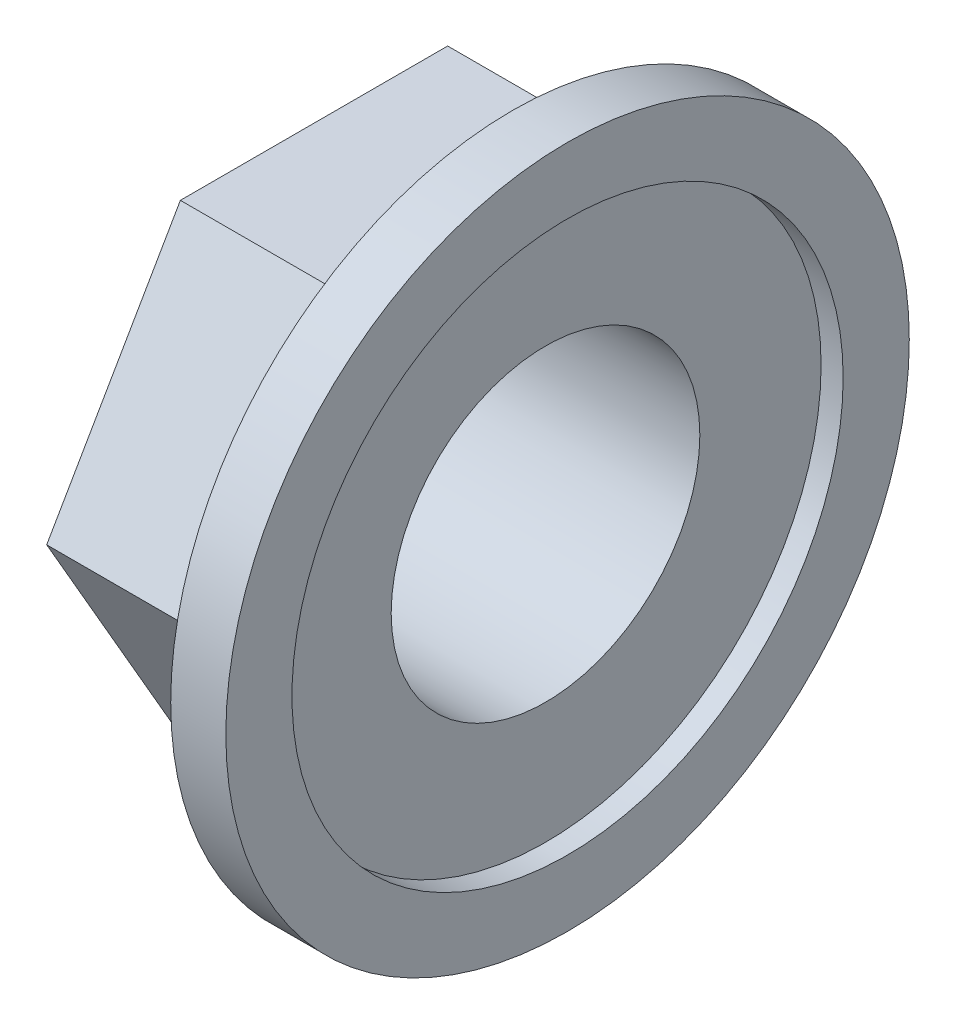
ISO-10303-21;
HEADER;
FILE_DESCRIPTION(('STEP AP214'),'2;1');
FILE_NAME('part.step','',(''),(''),'','','');
FILE_SCHEMA(('AUTOMOTIVE_DESIGN { 1 0 10303 214 1 1 1 1 }'));
ENDSEC;
DATA;
#1=APPLICATION_CONTEXT('core data for automotive mechanical design processes');
#2=APPLICATION_PROTOCOL_DEFINITION('international standard','automotive_design',2000,#1);
#3=PRODUCT_CONTEXT('',#1,'mechanical');
#4=PRODUCT('Part','Part','',(#3));
#5=PRODUCT_RELATED_PRODUCT_CATEGORY('part','',(#4));
#6=PRODUCT_DEFINITION_FORMATION('','',#4);
#7=PRODUCT_DEFINITION_CONTEXT('part definition',#1,'design');
#8=PRODUCT_DEFINITION('design','',#6,#7);
#9=PRODUCT_DEFINITION_SHAPE('','',#8);
#10=(LENGTH_UNIT() NAMED_UNIT(*) SI_UNIT(.MILLI.,.METRE.));
#11=(NAMED_UNIT(*) PLANE_ANGLE_UNIT() SI_UNIT($,.RADIAN.));
#12=(NAMED_UNIT(*) SI_UNIT($,.STERADIAN.) SOLID_ANGLE_UNIT());
#13=UNCERTAINTY_MEASURE_WITH_UNIT(LENGTH_MEASURE(1.E-05),#10,'distance_accuracy_value','');
#14=(GEOMETRIC_REPRESENTATION_CONTEXT(3) GLOBAL_UNCERTAINTY_ASSIGNED_CONTEXT((#13)) GLOBAL_UNIT_ASSIGNED_CONTEXT((#10,
#11,#12)) REPRESENTATION_CONTEXT('',''));
#15=CARTESIAN_POINT('',(0.,0.,0.));
#16=DIRECTION('',(0.,0.,1.));
#17=DIRECTION('',(1.,0.,0.));
#18=AXIS2_PLACEMENT_3D('',#15,#16,#17);
#19=CARTESIAN_POINT('',(0.,0.,0.));
#20=DIRECTION('',(1.,0.,0.));
#21=DIRECTION('',(0.,0.,-1.));
#22=AXIS2_PLACEMENT_3D('',#19,#20,#21);
#23=PLANE('',#22);
#24=CARTESIAN_POINT('',(0.,0.,0.));
#25=DIRECTION('',(1.,0.,0.));
#26=DIRECTION('',(0.,0.,-1.));
#27=AXIS2_PLACEMENT_3D('',#24,#25,#26);
#28=CIRCLE('',#27,15.5);
#29=CARTESIAN_POINT('',(0.,0.,-15.5));
#30=VERTEX_POINT('',#29);
#31=EDGE_CURVE('E49',#30,#30,#28,.T.);
#32=ORIENTED_EDGE('',*,*,#31,.F.);
#33=EDGE_LOOP('',(#32));
#34=FACE_BOUND('',#33,.T.);
#35=DIRECTION('',(0.,0.866025403784439,0.5));
#36=VECTOR('',#35,1.);
#37=CARTESIAN_POINT('',(0.,-10.5,6.06217782649107));
#38=LINE('',#37,#36);
#39=CARTESIAN_POINT('',(0.,-10.5,6.06217782649107));
#40=VERTEX_POINT('',#39);
#41=CARTESIAN_POINT('',(0.,0.,12.1243556529821));
#42=VERTEX_POINT('',#41);
#43=EDGE_CURVE('E57',#40,#42,#38,.T.);
#44=ORIENTED_EDGE('',*,*,#43,.F.);
#45=DIRECTION('',(0.,0.,1.));
#46=VECTOR('',#45,1.);
#47=CARTESIAN_POINT('',(0.,-10.5,-6.06217782649107));
#48=LINE('',#47,#46);
#49=CARTESIAN_POINT('',(0.,-10.5,-6.06217782649107));
#50=VERTEX_POINT('',#49);
#51=EDGE_CURVE('E61',#50,#40,#48,.T.);
#52=ORIENTED_EDGE('',*,*,#51,.F.);
#53=DIRECTION('',(0.,-0.866025403784438,0.5));
#54=VECTOR('',#53,1.);
#55=CARTESIAN_POINT('',(0.,0.,-12.1243556529821));
#56=LINE('',#55,#54);
#57=CARTESIAN_POINT('',(0.,0.,-12.1243556529821));
#58=VERTEX_POINT('',#57);
#59=EDGE_CURVE('E216',#58,#50,#56,.T.);
#60=ORIENTED_EDGE('',*,*,#59,.F.);
#61=DIRECTION('',(0.,-0.866025403784438,-0.5));
#62=VECTOR('',#61,1.);
#63=CARTESIAN_POINT('',(0.,10.5,-6.06217782649107));
#64=LINE('',#63,#62);
#65=CARTESIAN_POINT('',(0.,10.5,-6.06217782649107));
#66=VERTEX_POINT('',#65);
#67=EDGE_CURVE('E212',#66,#58,#64,.T.);
#68=ORIENTED_EDGE('',*,*,#67,.F.);
#69=DIRECTION('',(0.,0.,-1.));
#70=VECTOR('',#69,1.);
#71=CARTESIAN_POINT('',(0.,10.5,6.06217782649107));
#72=LINE('',#71,#70);
#73=CARTESIAN_POINT('',(0.,10.5,6.06217782649107));
#74=VERTEX_POINT('',#73);
#75=EDGE_CURVE('E208',#74,#66,#72,.T.);
#76=ORIENTED_EDGE('',*,*,#75,.F.);
#77=DIRECTION('',(0.,0.866025403784439,-0.5));
#78=VECTOR('',#77,1.);
#79=CARTESIAN_POINT('',(0.,0.,12.1243556529821));
#80=LINE('',#79,#78);
#81=EDGE_CURVE('E192',#42,#74,#80,.T.);
#82=ORIENTED_EDGE('',*,*,#81,.F.);
#83=EDGE_LOOP('',(#44,#52,#60,#68,#76,#82));
#84=FACE_BOUND('',#83,.T.);
#85=ADVANCED_FACE('F39',(#34,#84),#23,.F.);
#86=CARTESIAN_POINT('',(2.5,0.,0.));
#87=DIRECTION('',(-1.,0.,0.));
#88=DIRECTION('',(0.,0.,1.));
#89=AXIS2_PLACEMENT_3D('',#86,#87,#88);
#90=CYLINDRICAL_SURFACE('',#89,15.5);
#91=CARTESIAN_POINT('',(2.5,0.,0.));
#92=DIRECTION('',(1.,0.,0.));
#93=DIRECTION('',(0.,0.,-1.));
#94=AXIS2_PLACEMENT_3D('',#91,#92,#93);
#95=CIRCLE('',#94,15.5);
#96=CARTESIAN_POINT('',(2.5,0.,-15.5));
#97=VERTEX_POINT('',#96);
#98=EDGE_CURVE('E11',#97,#97,#95,.T.);
#99=ORIENTED_EDGE('',*,*,#98,.F.);
#100=EDGE_LOOP('',(#99));
#101=FACE_BOUND('',#100,.T.);
#102=ORIENTED_EDGE('',*,*,#31,.T.);
#103=EDGE_LOOP('',(#102));
#104=FACE_BOUND('',#103,.T.);
#105=ADVANCED_FACE('F41',(#101,#104),#90,.T.);
#106=CARTESIAN_POINT('',(2.5,0.,0.));
#107=DIRECTION('',(1.,0.,0.));
#108=DIRECTION('',(0.,0.,-1.));
#109=AXIS2_PLACEMENT_3D('',#106,#107,#108);
#110=PLANE('',#109);
#111=CARTESIAN_POINT('',(2.5,0.,0.));
#112=DIRECTION('',(1.,0.,0.));
#113=DIRECTION('',(0.,0.,-1.));
#114=AXIS2_PLACEMENT_3D('',#111,#112,#113);
#115=CIRCLE('',#114,12.5);
#116=CARTESIAN_POINT('',(2.5,0.,-12.5));
#117=VERTEX_POINT('',#116);
#118=EDGE_CURVE('E118',#117,#117,#115,.T.);
#119=ORIENTED_EDGE('',*,*,#118,.F.);
#120=EDGE_LOOP('',(#119));
#121=FACE_BOUND('',#120,.T.);
#122=ORIENTED_EDGE('',*,*,#98,.T.);
#123=EDGE_LOOP('',(#122));
#124=FACE_BOUND('',#123,.T.);
#125=ADVANCED_FACE('F140',(#121,#124),#110,.T.);
#126=CARTESIAN_POINT('',(1.5,0.,0.));
#127=DIRECTION('',(1.,0.,0.));
#128=DIRECTION('',(0.,0.,-1.));
#129=AXIS2_PLACEMENT_3D('',#126,#127,#128);
#130=CYLINDRICAL_SURFACE('',#129,12.5);
#131=CARTESIAN_POINT('',(1.5,0.,0.));
#132=DIRECTION('',(1.,0.,0.));
#133=DIRECTION('',(0.,0.,-1.));
#134=AXIS2_PLACEMENT_3D('',#131,#132,#133);
#135=CIRCLE('',#134,12.5);
#136=CARTESIAN_POINT('',(1.5,0.,-12.5));
#137=VERTEX_POINT('',#136);
#138=EDGE_CURVE('E123',#137,#137,#135,.T.);
#139=ORIENTED_EDGE('',*,*,#138,.F.);
#140=EDGE_LOOP('',(#139));
#141=FACE_BOUND('',#140,.T.);
#142=ORIENTED_EDGE('',*,*,#118,.T.);
#143=EDGE_LOOP('',(#142));
#144=FACE_BOUND('',#143,.T.);
#145=ADVANCED_FACE('F145',(#141,#144),#130,.F.);
#146=CARTESIAN_POINT('',(1.5,0.,0.));
#147=DIRECTION('',(1.,0.,0.));
#148=DIRECTION('',(0.,0.,-1.));
#149=AXIS2_PLACEMENT_3D('',#146,#147,#148);
#150=PLANE('',#149);
#151=CARTESIAN_POINT('',(1.5,0.,0.));
#152=DIRECTION('',(1.,0.,0.));
#153=DIRECTION('',(0.,0.,-1.));
#154=AXIS2_PLACEMENT_3D('',#151,#152,#153);
#155=CIRCLE('',#154,7.);
#156=CARTESIAN_POINT('',(1.5,0.,-7.));
#157=VERTEX_POINT('',#156);
#158=EDGE_CURVE('E185',#157,#157,#155,.T.);
#159=ORIENTED_EDGE('',*,*,#158,.F.);
#160=EDGE_LOOP('',(#159));
#161=FACE_BOUND('',#160,.T.);
#162=ORIENTED_EDGE('',*,*,#138,.T.);
#163=EDGE_LOOP('',(#162));
#164=FACE_BOUND('',#163,.T.);
#165=ADVANCED_FACE('F149',(#161,#164),#150,.T.);
#166=CARTESIAN_POINT('',(-9.,-10.5,6.06217782649107));
#167=DIRECTION('',(0.,0.5,-0.866025403784439));
#168=DIRECTION('',(0.,0.866025403784439,0.5));
#169=AXIS2_PLACEMENT_3D('',#166,#167,#168);
#170=PLANE('',#169);
#171=ORIENTED_EDGE('',*,*,#43,.T.);
#172=DIRECTION('',(1.,0.,0.));
#173=VECTOR('',#172,1.);
#174=CARTESIAN_POINT('',(-9.,0.,12.1243556529821));
#175=LINE('',#174,#173);
#176=CARTESIAN_POINT('',(-9.,0.,12.1243556529821));
#177=VERTEX_POINT('',#176);
#178=EDGE_CURVE('E98',#177,#42,#175,.T.);
#179=ORIENTED_EDGE('',*,*,#178,.F.);
#180=DIRECTION('',(0.,0.866025403784439,0.5));
#181=VECTOR('',#180,1.);
#182=CARTESIAN_POINT('',(-9.,-10.5,6.06217782649107));
#183=LINE('',#182,#181);
#184=CARTESIAN_POINT('',(-9.,-10.5,6.06217782649107));
#185=VERTEX_POINT('',#184);
#186=EDGE_CURVE('E105',#185,#177,#183,.T.);
#187=ORIENTED_EDGE('',*,*,#186,.F.);
#188=DIRECTION('',(1.,0.,0.));
#189=VECTOR('',#188,1.);
#190=CARTESIAN_POINT('',(-9.,-10.5,6.06217782649107));
#191=LINE('',#190,#189);
#192=EDGE_CURVE('E204',#185,#40,#191,.T.);
#193=ORIENTED_EDGE('',*,*,#192,.T.);
#194=EDGE_LOOP('',(#171,#179,#187,#193));
#195=FACE_BOUND('',#194,.T.);
#196=ADVANCED_FACE('F116',(#195),#170,.F.);
#197=CARTESIAN_POINT('',(-9.,0.,12.1243556529821));
#198=DIRECTION('',(0.,-0.5,-0.866025403784438));
#199=DIRECTION('',(0.,0.866025403784439,-0.5));
#200=AXIS2_PLACEMENT_3D('',#197,#198,#199);
#201=PLANE('',#200);
#202=ORIENTED_EDGE('',*,*,#81,.T.);
#203=DIRECTION('',(1.,0.,0.));
#204=VECTOR('',#203,1.);
#205=CARTESIAN_POINT('',(-9.,10.5,6.06217782649107));
#206=LINE('',#205,#204);
#207=CARTESIAN_POINT('',(-9.,10.5,6.06217782649107));
#208=VERTEX_POINT('',#207);
#209=EDGE_CURVE('E100',#208,#74,#206,.T.);
#210=ORIENTED_EDGE('',*,*,#209,.F.);
#211=DIRECTION('',(0.,0.866025403784439,-0.5));
#212=VECTOR('',#211,1.);
#213=CARTESIAN_POINT('',(-9.,0.,12.1243556529821));
#214=LINE('',#213,#212);
#215=EDGE_CURVE('E93',#177,#208,#214,.T.);
#216=ORIENTED_EDGE('',*,*,#215,.F.);
#217=ORIENTED_EDGE('',*,*,#178,.T.);
#218=EDGE_LOOP('',(#202,#210,#216,#217));
#219=FACE_BOUND('',#218,.T.);
#220=ADVANCED_FACE('F96',(#219),#201,.F.);
#221=CARTESIAN_POINT('',(-9.,10.5,6.06217782649107));
#222=DIRECTION('',(0.,-1.,0.));
#223=DIRECTION('',(0.,0.,-1.));
#224=AXIS2_PLACEMENT_3D('',#221,#222,#223);
#225=PLANE('',#224);
#226=ORIENTED_EDGE('',*,*,#75,.T.);
#227=DIRECTION('',(1.,0.,0.));
#228=VECTOR('',#227,1.);
#229=CARTESIAN_POINT('',(-9.,10.5,-6.06217782649107));
#230=LINE('',#229,#228);
#231=CARTESIAN_POINT('',(-9.,10.5,-6.06217782649107));
#232=VERTEX_POINT('',#231);
#233=EDGE_CURVE('E125',#232,#66,#230,.T.);
#234=ORIENTED_EDGE('',*,*,#233,.F.);
#235=DIRECTION('',(0.,0.,-1.));
#236=VECTOR('',#235,1.);
#237=CARTESIAN_POINT('',(-9.,10.5,6.06217782649107));
#238=LINE('',#237,#236);
#239=EDGE_CURVE('E104',#208,#232,#238,.T.);
#240=ORIENTED_EDGE('',*,*,#239,.F.);
#241=ORIENTED_EDGE('',*,*,#209,.T.);
#242=EDGE_LOOP('',(#226,#234,#240,#241));
#243=FACE_BOUND('',#242,.T.);
#244=ADVANCED_FACE('F158',(#243),#225,.F.);
#245=CARTESIAN_POINT('',(-9.,10.5,-6.06217782649107));
#246=DIRECTION('',(0.,-0.5,0.866025403784439));
#247=DIRECTION('',(0.,-0.866025403784439,-0.5));
#248=AXIS2_PLACEMENT_3D('',#245,#246,#247);
#249=PLANE('',#248);
#250=ORIENTED_EDGE('',*,*,#67,.T.);
#251=DIRECTION('',(1.,0.,0.));
#252=VECTOR('',#251,1.);
#253=CARTESIAN_POINT('',(-9.,0.,-12.1243556529821));
#254=LINE('',#253,#252);
#255=CARTESIAN_POINT('',(-9.,0.,-12.1243556529821));
#256=VERTEX_POINT('',#255);
#257=EDGE_CURVE('E227',#256,#58,#254,.T.);
#258=ORIENTED_EDGE('',*,*,#257,.F.);
#259=DIRECTION('',(0.,-0.866025403784438,-0.5));
#260=VECTOR('',#259,1.);
#261=CARTESIAN_POINT('',(-9.,10.5,-6.06217782649107));
#262=LINE('',#261,#260);
#263=EDGE_CURVE('E197',#232,#256,#262,.T.);
#264=ORIENTED_EDGE('',*,*,#263,.F.);
#265=ORIENTED_EDGE('',*,*,#233,.T.);
#266=EDGE_LOOP('',(#250,#258,#264,#265));
#267=FACE_BOUND('',#266,.T.);
#268=ADVANCED_FACE('F161',(#267),#249,.F.);
#269=CARTESIAN_POINT('',(-9.,0.,-12.1243556529821));
#270=DIRECTION('',(0.,0.5,0.866025403784438));
#271=DIRECTION('',(0.,-0.866025403784438,0.5));
#272=AXIS2_PLACEMENT_3D('',#269,#270,#271);
#273=PLANE('',#272);
#274=ORIENTED_EDGE('',*,*,#59,.T.);
#275=DIRECTION('',(1.,0.,0.));
#276=VECTOR('',#275,1.);
#277=CARTESIAN_POINT('',(-9.,-10.5,-6.06217782649107));
#278=LINE('',#277,#276);
#279=CARTESIAN_POINT('',(-9.,-10.5,-6.06217782649107));
#280=VERTEX_POINT('',#279);
#281=EDGE_CURVE('E223',#280,#50,#278,.T.);
#282=ORIENTED_EDGE('',*,*,#281,.F.);
#283=DIRECTION('',(0.,-0.866025403784438,0.5));
#284=VECTOR('',#283,1.);
#285=CARTESIAN_POINT('',(-9.,0.,-12.1243556529821));
#286=LINE('',#285,#284);
#287=EDGE_CURVE('E200',#256,#280,#286,.T.);
#288=ORIENTED_EDGE('',*,*,#287,.F.);
#289=ORIENTED_EDGE('',*,*,#257,.T.);
#290=EDGE_LOOP('',(#274,#282,#288,#289));
#291=FACE_BOUND('',#290,.T.);
#292=ADVANCED_FACE('F165',(#291),#273,.F.);
#293=CARTESIAN_POINT('',(-9.,-10.5,-6.06217782649107));
#294=DIRECTION('',(0.,1.,0.));
#295=DIRECTION('',(0.,0.,1.));
#296=AXIS2_PLACEMENT_3D('',#293,#294,#295);
#297=PLANE('',#296);
#298=ORIENTED_EDGE('',*,*,#51,.T.);
#299=ORIENTED_EDGE('',*,*,#192,.F.);
#300=DIRECTION('',(0.,0.,1.));
#301=VECTOR('',#300,1.);
#302=CARTESIAN_POINT('',(-9.,-10.5,-6.06217782649107));
#303=LINE('',#302,#301);
#304=EDGE_CURVE('E110',#280,#185,#303,.T.);
#305=ORIENTED_EDGE('',*,*,#304,.F.);
#306=ORIENTED_EDGE('',*,*,#281,.T.);
#307=EDGE_LOOP('',(#298,#299,#305,#306));
#308=FACE_BOUND('',#307,.T.);
#309=ADVANCED_FACE('F169',(#308),#297,.F.);
#310=CARTESIAN_POINT('',(-9.,0.,0.));
#311=DIRECTION('',(-1.,0.,0.));
#312=DIRECTION('',(0.,0.,1.));
#313=AXIS2_PLACEMENT_3D('',#310,#311,#312);
#314=PLANE('',#313);
#315=CARTESIAN_POINT('',(-9.,0.,0.));
#316=DIRECTION('',(-1.,0.,0.));
#317=DIRECTION('',(0.,0.,1.));
#318=AXIS2_PLACEMENT_3D('',#315,#316,#317);
#319=CIRCLE('',#318,7.);
#320=CARTESIAN_POINT('',(-9.,0.,7.));
#321=VERTEX_POINT('',#320);
#322=EDGE_CURVE('E43',#321,#321,#319,.T.);
#323=ORIENTED_EDGE('',*,*,#322,.F.);
#324=EDGE_LOOP('',(#323));
#325=FACE_BOUND('',#324,.T.);
#326=ORIENTED_EDGE('',*,*,#186,.T.);
#327=ORIENTED_EDGE('',*,*,#215,.T.);
#328=ORIENTED_EDGE('',*,*,#239,.T.);
#329=ORIENTED_EDGE('',*,*,#263,.T.);
#330=ORIENTED_EDGE('',*,*,#287,.T.);
#331=ORIENTED_EDGE('',*,*,#304,.T.);
#332=EDGE_LOOP('',(#326,#327,#328,#329,#330,#331));
#333=FACE_BOUND('',#332,.T.);
#334=ADVANCED_FACE('F108',(#325,#333),#314,.T.);
#335=CARTESIAN_POINT('',(2.5,0.,0.));
#336=DIRECTION('',(-1.,0.,0.));
#337=DIRECTION('',(0.,0.,1.));
#338=AXIS2_PLACEMENT_3D('',#335,#336,#337);
#339=CYLINDRICAL_SURFACE('',#338,7.);
#340=ORIENTED_EDGE('',*,*,#158,.T.);
#341=EDGE_LOOP('',(#340));
#342=FACE_BOUND('',#341,.T.);
#343=ORIENTED_EDGE('',*,*,#322,.T.);
#344=EDGE_LOOP('',(#343));
#345=FACE_BOUND('',#344,.T.);
#346=ADVANCED_FACE('F176',(#342,#345),#339,.F.);
#347=CLOSED_SHELL('',(#85,#105,#125,#145,#165,#196,#220,#244,#268,#292,#309,#334,#346));
#348=MANIFOLD_SOLID_BREP('B2',#347);
#349=ADVANCED_BREP_SHAPE_REPRESENTATION('',(#18,#348),#14);
#350=SHAPE_DEFINITION_REPRESENTATION(#9,#349);
ENDSEC;
END-ISO-10303-21;
